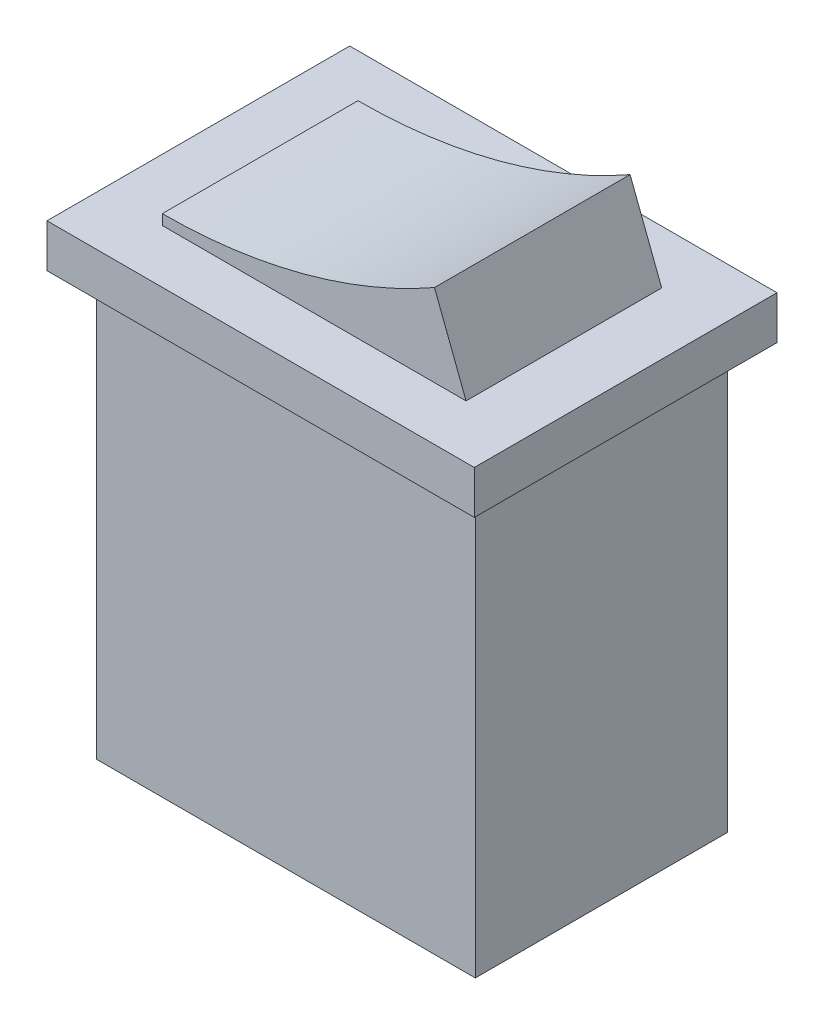
ISO-10303-21;
HEADER;
FILE_DESCRIPTION(('STEP AP214'),'2;1');
FILE_NAME('part.step','',(''),(''),'','','');
FILE_SCHEMA(('AUTOMOTIVE_DESIGN { 1 0 10303 214 1 1 1 1 }'));
ENDSEC;
DATA;
#1=APPLICATION_CONTEXT('core data for automotive mechanical design processes');
#2=APPLICATION_PROTOCOL_DEFINITION('international standard','automotive_design',2000,#1);
#3=PRODUCT_CONTEXT('',#1,'mechanical');
#4=PRODUCT('Part','Part','',(#3));
#5=PRODUCT_RELATED_PRODUCT_CATEGORY('part','',(#4));
#6=PRODUCT_DEFINITION_FORMATION('','',#4);
#7=PRODUCT_DEFINITION_CONTEXT('part definition',#1,'design');
#8=PRODUCT_DEFINITION('design','',#6,#7);
#9=PRODUCT_DEFINITION_SHAPE('','',#8);
#10=(LENGTH_UNIT() NAMED_UNIT(*) SI_UNIT(.MILLI.,.METRE.));
#11=(NAMED_UNIT(*) PLANE_ANGLE_UNIT() SI_UNIT($,.RADIAN.));
#12=(NAMED_UNIT(*) SI_UNIT($,.STERADIAN.) SOLID_ANGLE_UNIT());
#13=UNCERTAINTY_MEASURE_WITH_UNIT(LENGTH_MEASURE(1.E-05),#10,'distance_accuracy_value','');
#14=(GEOMETRIC_REPRESENTATION_CONTEXT(3) GLOBAL_UNCERTAINTY_ASSIGNED_CONTEXT((#13)) GLOBAL_UNIT_ASSIGNED_CONTEXT((#10,
#11,#12)) REPRESENTATION_CONTEXT('',''));
#15=CARTESIAN_POINT('',(0.,0.,0.));
#16=DIRECTION('',(0.,0.,1.));
#17=DIRECTION('',(1.,0.,0.));
#18=AXIS2_PLACEMENT_3D('',#15,#16,#17);
#19=CARTESIAN_POINT('',(0.,12.385,-7.35));
#20=DIRECTION('',(0.,1.,0.));
#21=DIRECTION('',(-1.,0.,0.));
#22=AXIS2_PLACEMENT_3D('',#19,#20,#21);
#23=PLANE('',#22);
#24=DIRECTION('',(0.,0.,1.));
#25=VECTOR('',#24,1.);
#26=CARTESIAN_POINT('',(-10.375,12.385,-7.35));
#27=LINE('',#26,#25);
#28=CARTESIAN_POINT('',(-10.375,12.385,-7.35));
#29=VERTEX_POINT('',#28);
#30=CARTESIAN_POINT('',(-10.375,12.385,7.35));
#31=VERTEX_POINT('',#30);
#32=EDGE_CURVE('E209',#29,#31,#27,.T.);
#33=ORIENTED_EDGE('',*,*,#32,.T.);
#34=DIRECTION('',(-1.,0.,0.));
#35=VECTOR('',#34,1.);
#36=CARTESIAN_POINT('',(0.,12.385,7.35));
#37=LINE('',#36,#35);
#38=CARTESIAN_POINT('',(10.375,12.385,7.35));
#39=VERTEX_POINT('',#38);
#40=EDGE_CURVE('E175',#39,#31,#37,.T.);
#41=ORIENTED_EDGE('',*,*,#40,.F.);
#42=DIRECTION('',(0.,0.,1.));
#43=VECTOR('',#42,1.);
#44=CARTESIAN_POINT('',(10.375,12.385,-7.35));
#45=LINE('',#44,#43);
#46=CARTESIAN_POINT('',(10.375,12.385,-7.35));
#47=VERTEX_POINT('',#46);
#48=EDGE_CURVE('E210',#47,#39,#45,.T.);
#49=ORIENTED_EDGE('',*,*,#48,.F.);
#50=DIRECTION('',(-1.,0.,0.));
#51=VECTOR('',#50,1.);
#52=CARTESIAN_POINT('',(0.,12.385,-7.35));
#53=LINE('',#52,#51);
#54=EDGE_CURVE('E195',#47,#29,#53,.T.);
#55=ORIENTED_EDGE('',*,*,#54,.T.);
#56=EDGE_LOOP('',(#33,#41,#49,#55));
#57=FACE_BOUND('',#56,.T.);
#58=DIRECTION('',(-1.,0.,0.));
#59=VECTOR('',#58,1.);
#60=CARTESIAN_POINT('',(0.,12.385,-4.75));
#61=LINE('',#60,#59);
#62=CARTESIAN_POINT('',(7.375,12.385,-4.75));
#63=VERTEX_POINT('',#62);
#64=CARTESIAN_POINT('',(-7.375,12.385,-4.75));
#65=VERTEX_POINT('',#64);
#66=EDGE_CURVE('E165',#63,#65,#61,.T.);
#67=ORIENTED_EDGE('',*,*,#66,.F.);
#68=DIRECTION('',(0.,0.,1.));
#69=VECTOR('',#68,1.);
#70=CARTESIAN_POINT('',(7.375,12.385,-4.75));
#71=LINE('',#70,#69);
#72=CARTESIAN_POINT('',(7.375,12.385,4.75));
#73=VERTEX_POINT('',#72);
#74=EDGE_CURVE('E57',#63,#73,#71,.T.);
#75=ORIENTED_EDGE('',*,*,#74,.T.);
#76=DIRECTION('',(-1.,0.,0.));
#77=VECTOR('',#76,1.);
#78=CARTESIAN_POINT('',(0.,12.385,4.75));
#79=LINE('',#78,#77);
#80=CARTESIAN_POINT('',(-7.375,12.385,4.75));
#81=VERTEX_POINT('',#80);
#82=EDGE_CURVE('E61',#73,#81,#79,.T.);
#83=ORIENTED_EDGE('',*,*,#82,.T.);
#84=DIRECTION('',(0.,0.,1.));
#85=VECTOR('',#84,1.);
#86=CARTESIAN_POINT('',(-7.375,12.385,-4.75));
#87=LINE('',#86,#85);
#88=EDGE_CURVE('E141',#65,#81,#87,.T.);
#89=ORIENTED_EDGE('',*,*,#88,.F.);
#90=EDGE_LOOP('',(#67,#75,#83,#89));
#91=FACE_BOUND('',#90,.T.);
#92=ADVANCED_FACE('F41',(#57,#91),#23,.T.);
#93=CARTESIAN_POINT('',(-9.2,-10.285,-6.125));
#94=DIRECTION('',(1.,0.,0.));
#95=DIRECTION('',(0.,0.,-1.));
#96=AXIS2_PLACEMENT_3D('',#93,#94,#95);
#97=PLANE('',#96);
#98=DIRECTION('',(0.,0.,1.));
#99=VECTOR('',#98,1.);
#100=CARTESIAN_POINT('',(-9.2,-10.285,-6.125));
#101=LINE('',#100,#99);
#102=CARTESIAN_POINT('',(-9.2,-10.285,-6.125));
#103=VERTEX_POINT('',#102);
#104=CARTESIAN_POINT('',(-9.2,-10.285,6.125));
#105=VERTEX_POINT('',#104);
#106=EDGE_CURVE('E252',#103,#105,#101,.T.);
#107=ORIENTED_EDGE('',*,*,#106,.T.);
#108=DIRECTION('',(0.,1.,0.));
#109=VECTOR('',#108,1.);
#110=CARTESIAN_POINT('',(-9.2,-10.285,6.125));
#111=LINE('',#110,#109);
#112=CARTESIAN_POINT('',(-9.2,10.285,6.125));
#113=VERTEX_POINT('',#112);
#114=EDGE_CURVE('E213',#105,#113,#111,.T.);
#115=ORIENTED_EDGE('',*,*,#114,.T.);
#116=DIRECTION('',(0.,0.,1.));
#117=VECTOR('',#116,1.);
#118=CARTESIAN_POINT('',(-9.2,10.285,-6.125));
#119=LINE('',#118,#117);
#120=CARTESIAN_POINT('',(-9.2,10.285,-6.125));
#121=VERTEX_POINT('',#120);
#122=EDGE_CURVE('E11',#121,#113,#119,.T.);
#123=ORIENTED_EDGE('',*,*,#122,.F.);
#124=DIRECTION('',(0.,1.,0.));
#125=VECTOR('',#124,1.);
#126=CARTESIAN_POINT('',(-9.2,-10.285,-6.125));
#127=LINE('',#126,#125);
#128=EDGE_CURVE('E236',#103,#121,#127,.T.);
#129=ORIENTED_EDGE('',*,*,#128,.F.);
#130=EDGE_LOOP('',(#107,#115,#123,#129));
#131=FACE_BOUND('',#130,.T.);
#132=ADVANCED_FACE('F43',(#131),#97,.F.);
#133=CARTESIAN_POINT('',(9.2,-10.285,-6.125));
#134=DIRECTION('',(1.,0.,0.));
#135=DIRECTION('',(0.,0.,-1.));
#136=AXIS2_PLACEMENT_3D('',#133,#134,#135);
#137=PLANE('',#136);
#138=DIRECTION('',(0.,0.,1.));
#139=VECTOR('',#138,1.);
#140=CARTESIAN_POINT('',(9.2,10.285,-6.125));
#141=LINE('',#140,#139);
#142=CARTESIAN_POINT('',(9.2,10.285,-6.125));
#143=VERTEX_POINT('',#142);
#144=CARTESIAN_POINT('',(9.2,10.285,6.125));
#145=VERTEX_POINT('',#144);
#146=EDGE_CURVE('E50',#143,#145,#141,.T.);
#147=ORIENTED_EDGE('',*,*,#146,.T.);
#148=DIRECTION('',(0.,1.,0.));
#149=VECTOR('',#148,1.);
#150=CARTESIAN_POINT('',(9.2,-10.285,6.125));
#151=LINE('',#150,#149);
#152=CARTESIAN_POINT('',(9.2,-10.285,6.125));
#153=VERTEX_POINT('',#152);
#154=EDGE_CURVE('E228',#153,#145,#151,.T.);
#155=ORIENTED_EDGE('',*,*,#154,.F.);
#156=DIRECTION('',(0.,0.,1.));
#157=VECTOR('',#156,1.);
#158=CARTESIAN_POINT('',(9.2,-10.285,-6.125));
#159=LINE('',#158,#157);
#160=CARTESIAN_POINT('',(9.2,-10.285,-6.125));
#161=VERTEX_POINT('',#160);
#162=EDGE_CURVE('E255',#161,#153,#159,.T.);
#163=ORIENTED_EDGE('',*,*,#162,.F.);
#164=DIRECTION('',(0.,1.,0.));
#165=VECTOR('',#164,1.);
#166=CARTESIAN_POINT('',(9.2,-10.285,-6.125));
#167=LINE('',#166,#165);
#168=EDGE_CURVE('E244',#161,#143,#167,.T.);
#169=ORIENTED_EDGE('',*,*,#168,.T.);
#170=EDGE_LOOP('',(#147,#155,#163,#169));
#171=FACE_BOUND('',#170,.T.);
#172=ADVANCED_FACE('F261',(#171),#137,.T.);
#173=CARTESIAN_POINT('',(-9.2,-10.285,-6.125));
#174=DIRECTION('',(0.,-1.,0.));
#175=DIRECTION('',(0.,0.,-1.));
#176=AXIS2_PLACEMENT_3D('',#173,#174,#175);
#177=PLANE('',#176);
#178=ORIENTED_EDGE('',*,*,#162,.T.);
#179=DIRECTION('',(1.,0.,0.));
#180=VECTOR('',#179,1.);
#181=CARTESIAN_POINT('',(-9.2,-10.285,6.125));
#182=LINE('',#181,#180);
#183=EDGE_CURVE('E232',#105,#153,#182,.T.);
#184=ORIENTED_EDGE('',*,*,#183,.F.);
#185=ORIENTED_EDGE('',*,*,#106,.F.);
#186=DIRECTION('',(1.,0.,0.));
#187=VECTOR('',#186,1.);
#188=CARTESIAN_POINT('',(-9.2,-10.285,-6.125));
#189=LINE('',#188,#187);
#190=EDGE_CURVE('E248',#103,#161,#189,.T.);
#191=ORIENTED_EDGE('',*,*,#190,.T.);
#192=EDGE_LOOP('',(#178,#184,#185,#191));
#193=FACE_BOUND('',#192,.T.);
#194=ADVANCED_FACE('F270',(#193),#177,.T.);
#195=CARTESIAN_POINT('',(0.,0.,-6.125));
#196=DIRECTION('',(0.,0.,-1.));
#197=DIRECTION('',(-1.,0.,0.));
#198=AXIS2_PLACEMENT_3D('',#195,#196,#197);
#199=PLANE('',#198);
#200=ORIENTED_EDGE('',*,*,#128,.T.);
#201=DIRECTION('',(1.,0.,0.));
#202=VECTOR('',#201,1.);
#203=CARTESIAN_POINT('',(-9.2,10.285,-6.125));
#204=LINE('',#203,#202);
#205=EDGE_CURVE('E240',#121,#143,#204,.T.);
#206=ORIENTED_EDGE('',*,*,#205,.T.);
#207=ORIENTED_EDGE('',*,*,#168,.F.);
#208=ORIENTED_EDGE('',*,*,#190,.F.);
#209=EDGE_LOOP('',(#200,#206,#207,#208));
#210=FACE_BOUND('',#209,.T.);
#211=ADVANCED_FACE('F274',(#210),#199,.T.);
#212=CARTESIAN_POINT('',(0.,0.,6.125));
#213=DIRECTION('',(0.,0.,-1.));
#214=DIRECTION('',(-1.,0.,0.));
#215=AXIS2_PLACEMENT_3D('',#212,#213,#214);
#216=PLANE('',#215);
#217=ORIENTED_EDGE('',*,*,#114,.F.);
#218=ORIENTED_EDGE('',*,*,#183,.T.);
#219=ORIENTED_EDGE('',*,*,#154,.T.);
#220=DIRECTION('',(1.,0.,0.));
#221=VECTOR('',#220,1.);
#222=CARTESIAN_POINT('',(-9.2,10.285,6.125));
#223=LINE('',#222,#221);
#224=EDGE_CURVE('E225',#113,#145,#223,.T.);
#225=ORIENTED_EDGE('',*,*,#224,.F.);
#226=EDGE_LOOP('',(#217,#218,#219,#225));
#227=FACE_BOUND('',#226,.T.);
#228=ADVANCED_FACE('F267',(#227),#216,.F.);
#229=CARTESIAN_POINT('',(0.,10.285,-7.35));
#230=DIRECTION('',(0.,1.,0.));
#231=DIRECTION('',(-1.,0.,0.));
#232=AXIS2_PLACEMENT_3D('',#229,#230,#231);
#233=PLANE('',#232);
#234=DIRECTION('',(0.,0.,1.));
#235=VECTOR('',#234,1.);
#236=CARTESIAN_POINT('',(10.375,10.285,-7.35));
#237=LINE('',#236,#235);
#238=CARTESIAN_POINT('',(10.375,10.285,-7.35));
#239=VERTEX_POINT('',#238);
#240=CARTESIAN_POINT('',(10.375,10.285,7.35));
#241=VERTEX_POINT('',#240);
#242=EDGE_CURVE('E214',#239,#241,#237,.T.);
#243=ORIENTED_EDGE('',*,*,#242,.T.);
#244=DIRECTION('',(-1.,0.,0.));
#245=VECTOR('',#244,1.);
#246=CARTESIAN_POINT('',(0.,10.285,7.35));
#247=LINE('',#246,#245);
#248=CARTESIAN_POINT('',(-10.375,10.285,7.35));
#249=VERTEX_POINT('',#248);
#250=EDGE_CURVE('E187',#241,#249,#247,.T.);
#251=ORIENTED_EDGE('',*,*,#250,.T.);
#252=DIRECTION('',(0.,0.,1.));
#253=VECTOR('',#252,1.);
#254=CARTESIAN_POINT('',(-10.375,10.285,-7.35));
#255=LINE('',#254,#253);
#256=CARTESIAN_POINT('',(-10.375,10.285,-7.35));
#257=VERTEX_POINT('',#256);
#258=EDGE_CURVE('E217',#257,#249,#255,.T.);
#259=ORIENTED_EDGE('',*,*,#258,.F.);
#260=DIRECTION('',(-1.,0.,0.));
#261=VECTOR('',#260,1.);
#262=CARTESIAN_POINT('',(0.,10.285,-7.35));
#263=LINE('',#262,#261);
#264=EDGE_CURVE('E203',#239,#257,#263,.T.);
#265=ORIENTED_EDGE('',*,*,#264,.F.);
#266=EDGE_LOOP('',(#243,#251,#259,#265));
#267=FACE_BOUND('',#266,.T.);
#268=ORIENTED_EDGE('',*,*,#205,.F.);
#269=ORIENTED_EDGE('',*,*,#122,.T.);
#270=ORIENTED_EDGE('',*,*,#224,.T.);
#271=ORIENTED_EDGE('',*,*,#146,.F.);
#272=EDGE_LOOP('',(#268,#269,#270,#271));
#273=FACE_BOUND('',#272,.T.);
#274=ADVANCED_FACE('F276',(#267,#273),#233,.F.);
#275=CARTESIAN_POINT('',(10.375,0.,-7.35));
#276=DIRECTION('',(-1.,0.,0.));
#277=DIRECTION('',(0.,0.,1.));
#278=AXIS2_PLACEMENT_3D('',#275,#276,#277);
#279=PLANE('',#278);
#280=ORIENTED_EDGE('',*,*,#48,.T.);
#281=DIRECTION('',(0.,-1.,0.));
#282=VECTOR('',#281,1.);
#283=CARTESIAN_POINT('',(10.375,0.,7.35));
#284=LINE('',#283,#282);
#285=EDGE_CURVE('E191',#39,#241,#284,.T.);
#286=ORIENTED_EDGE('',*,*,#285,.T.);
#287=ORIENTED_EDGE('',*,*,#242,.F.);
#288=DIRECTION('',(0.,-1.,0.));
#289=VECTOR('',#288,1.);
#290=CARTESIAN_POINT('',(10.375,0.,-7.35));
#291=LINE('',#290,#289);
#292=EDGE_CURVE('E206',#47,#239,#291,.T.);
#293=ORIENTED_EDGE('',*,*,#292,.F.);
#294=EDGE_LOOP('',(#280,#286,#287,#293));
#295=FACE_BOUND('',#294,.T.);
#296=ADVANCED_FACE('F315',(#295),#279,.F.);
#297=CARTESIAN_POINT('',(-10.375,0.,-7.35));
#298=DIRECTION('',(-1.,0.,0.));
#299=DIRECTION('',(0.,-1.,0.));
#300=AXIS2_PLACEMENT_3D('',#297,#298,#299);
#301=PLANE('',#300);
#302=ORIENTED_EDGE('',*,*,#258,.T.);
#303=DIRECTION('',(0.,-1.,0.));
#304=VECTOR('',#303,1.);
#305=CARTESIAN_POINT('',(-10.375,0.,7.35));
#306=LINE('',#305,#304);
#307=EDGE_CURVE('E183',#31,#249,#306,.T.);
#308=ORIENTED_EDGE('',*,*,#307,.F.);
#309=ORIENTED_EDGE('',*,*,#32,.F.);
#310=DIRECTION('',(0.,-1.,0.));
#311=VECTOR('',#310,1.);
#312=CARTESIAN_POINT('',(-10.375,0.,-7.35));
#313=LINE('',#312,#311);
#314=EDGE_CURVE('E199',#29,#257,#313,.T.);
#315=ORIENTED_EDGE('',*,*,#314,.T.);
#316=EDGE_LOOP('',(#302,#308,#309,#315));
#317=FACE_BOUND('',#316,.T.);
#318=ADVANCED_FACE('F289',(#317),#301,.T.);
#319=CARTESIAN_POINT('',(0.,0.,-7.35));
#320=DIRECTION('',(0.,0.,1.));
#321=DIRECTION('',(1.,0.,0.));
#322=AXIS2_PLACEMENT_3D('',#319,#320,#321);
#323=PLANE('',#322);
#324=ORIENTED_EDGE('',*,*,#54,.F.);
#325=ORIENTED_EDGE('',*,*,#292,.T.);
#326=ORIENTED_EDGE('',*,*,#264,.T.);
#327=ORIENTED_EDGE('',*,*,#314,.F.);
#328=EDGE_LOOP('',(#324,#325,#326,#327));
#329=FACE_BOUND('',#328,.T.);
#330=ADVANCED_FACE('F329',(#329),#323,.F.);
#331=CARTESIAN_POINT('',(0.,0.,7.35));
#332=DIRECTION('',(0.,0.,1.));
#333=DIRECTION('',(1.,0.,0.));
#334=AXIS2_PLACEMENT_3D('',#331,#332,#333);
#335=PLANE('',#334);
#336=ORIENTED_EDGE('',*,*,#40,.T.);
#337=ORIENTED_EDGE('',*,*,#307,.T.);
#338=ORIENTED_EDGE('',*,*,#250,.F.);
#339=ORIENTED_EDGE('',*,*,#285,.F.);
#340=EDGE_LOOP('',(#336,#337,#338,#339));
#341=FACE_BOUND('',#340,.T.);
#342=ADVANCED_FACE('F336',(#341),#335,.T.);
#343=CARTESIAN_POINT('',(-7.375,39.5866487245418,-4.75));
#344=DIRECTION('',(0.,0.,1.));
#345=DIRECTION('',(1.,0.,0.));
#346=AXIS2_PLACEMENT_3D('',#343,#344,#345);
#347=CYLINDRICAL_SURFACE('',#346,26.7016487245418);
#348=DIRECTION('',(0.,0.,1.));
#349=VECTOR('',#348,1.);
#350=CARTESIAN_POINT('',(-7.375,12.885,-4.75));
#351=LINE('',#350,#349);
#352=CARTESIAN_POINT('',(-7.375,12.885,-4.75));
#353=VERTEX_POINT('',#352);
#354=CARTESIAN_POINT('',(-7.375,12.885,4.75));
#355=VERTEX_POINT('',#354);
#356=EDGE_CURVE('E129',#353,#355,#351,.T.);
#357=ORIENTED_EDGE('',*,*,#356,.T.);
#358=CARTESIAN_POINT('',(-7.375,39.5866487245418,4.75));
#359=DIRECTION('',(0.,0.,1.));
#360=DIRECTION('',(1.,0.,0.));
#361=AXIS2_PLACEMENT_3D('',#358,#359,#360);
#362=CIRCLE('',#361,26.7016487245418);
#363=CARTESIAN_POINT('',(5.84095781893212,16.385,4.75));
#364=VERTEX_POINT('',#363);
#365=EDGE_CURVE('E133',#355,#364,#362,.T.);
#366=ORIENTED_EDGE('',*,*,#365,.T.);
#367=DIRECTION('',(0.,0.,1.));
#368=VECTOR('',#367,1.);
#369=CARTESIAN_POINT('',(5.84095781893212,16.385,-4.75));
#370=LINE('',#369,#368);
#371=CARTESIAN_POINT('',(5.84095781893212,16.385,-4.75));
#372=VERTEX_POINT('',#371);
#373=EDGE_CURVE('E172',#372,#364,#370,.T.);
#374=ORIENTED_EDGE('',*,*,#373,.F.);
#375=CARTESIAN_POINT('',(-7.375,39.5866487245418,-4.75));
#376=DIRECTION('',(0.,0.,1.));
#377=DIRECTION('',(1.,0.,0.));
#378=AXIS2_PLACEMENT_3D('',#375,#376,#377);
#379=CIRCLE('',#378,26.7016487245418);
#380=EDGE_CURVE('E136',#353,#372,#379,.T.);
#381=ORIENTED_EDGE('',*,*,#380,.F.);
#382=EDGE_LOOP('',(#357,#366,#374,#381));
#383=FACE_BOUND('',#382,.T.);
#384=ADVANCED_FACE('F131',(#383),#347,.F.);
#385=CARTESIAN_POINT('',(10.570121113551,4.05375291179588,-4.75));
#386=DIRECTION('',(-0.933690805506072,-0.358080269930391,0.));
#387=DIRECTION('',(0.358080269930391,-0.933690805506073,0.));
#388=AXIS2_PLACEMENT_3D('',#385,#386,#387);
#389=PLANE('',#388);
#390=ORIENTED_EDGE('',*,*,#373,.T.);
#391=DIRECTION('',(0.358080269930391,-0.933690805506072,0.));
#392=VECTOR('',#391,1.);
#393=CARTESIAN_POINT('',(10.570121113551,4.05375291179588,4.75));
#394=LINE('',#393,#392);
#395=EDGE_CURVE('E149',#364,#73,#394,.T.);
#396=ORIENTED_EDGE('',*,*,#395,.T.);
#397=ORIENTED_EDGE('',*,*,#74,.F.);
#398=DIRECTION('',(0.358080269930391,-0.933690805506072,0.));
#399=VECTOR('',#398,1.);
#400=CARTESIAN_POINT('',(10.570121113551,4.05375291179588,-4.75));
#401=LINE('',#400,#399);
#402=EDGE_CURVE('E142',#372,#63,#401,.T.);
#403=ORIENTED_EDGE('',*,*,#402,.F.);
#404=EDGE_LOOP('',(#390,#396,#397,#403));
#405=FACE_BOUND('',#404,.T.);
#406=ADVANCED_FACE('F350',(#405),#389,.F.);
#407=CARTESIAN_POINT('',(-7.37500000000002,0.,-4.75));
#408=DIRECTION('',(1.,0.,0.));
#409=DIRECTION('',(0.,1.,0.));
#410=AXIS2_PLACEMENT_3D('',#407,#408,#409);
#411=PLANE('',#410);
#412=ORIENTED_EDGE('',*,*,#88,.T.);
#413=DIRECTION('',(0.,1.,0.));
#414=VECTOR('',#413,1.);
#415=CARTESIAN_POINT('',(-7.37500000000002,0.,4.75));
#416=LINE('',#415,#414);
#417=EDGE_CURVE('E147',#81,#355,#416,.T.);
#418=ORIENTED_EDGE('',*,*,#417,.T.);
#419=ORIENTED_EDGE('',*,*,#356,.F.);
#420=DIRECTION('',(0.,1.,0.));
#421=VECTOR('',#420,1.);
#422=CARTESIAN_POINT('',(-7.37500000000002,0.,-4.75));
#423=LINE('',#422,#421);
#424=EDGE_CURVE('E162',#65,#353,#423,.T.);
#425=ORIENTED_EDGE('',*,*,#424,.F.);
#426=EDGE_LOOP('',(#412,#418,#419,#425));
#427=FACE_BOUND('',#426,.T.);
#428=ADVANCED_FACE('F152',(#427),#411,.F.);
#429=CARTESIAN_POINT('',(0.,0.,-4.75));
#430=DIRECTION('',(0.,0.,1.));
#431=DIRECTION('',(1.,0.,0.));
#432=AXIS2_PLACEMENT_3D('',#429,#430,#431);
#433=PLANE('',#432);
#434=ORIENTED_EDGE('',*,*,#380,.T.);
#435=ORIENTED_EDGE('',*,*,#402,.T.);
#436=ORIENTED_EDGE('',*,*,#66,.T.);
#437=ORIENTED_EDGE('',*,*,#424,.T.);
#438=EDGE_LOOP('',(#434,#435,#436,#437));
#439=FACE_BOUND('',#438,.T.);
#440=ADVANCED_FACE('F365',(#439),#433,.F.);
#441=CARTESIAN_POINT('',(0.,0.,4.75));
#442=DIRECTION('',(0.,0.,1.));
#443=DIRECTION('',(1.,0.,0.));
#444=AXIS2_PLACEMENT_3D('',#441,#442,#443);
#445=PLANE('',#444);
#446=ORIENTED_EDGE('',*,*,#365,.F.);
#447=ORIENTED_EDGE('',*,*,#417,.F.);
#448=ORIENTED_EDGE('',*,*,#82,.F.);
#449=ORIENTED_EDGE('',*,*,#395,.F.);
#450=EDGE_LOOP('',(#446,#447,#448,#449));
#451=FACE_BOUND('',#450,.T.);
#452=ADVANCED_FACE('F146',(#451),#445,.T.);
#453=CLOSED_SHELL('',(#92,#132,#172,#194,#211,#228,#274,#296,#318,#330,#342,#384,#406,#428,#440,#452));
#454=MANIFOLD_SOLID_BREP('B2',#453);
#455=ADVANCED_BREP_SHAPE_REPRESENTATION('',(#18,#454),#14);
#456=SHAPE_DEFINITION_REPRESENTATION(#9,#455);
ENDSEC;
END-ISO-10303-21;
